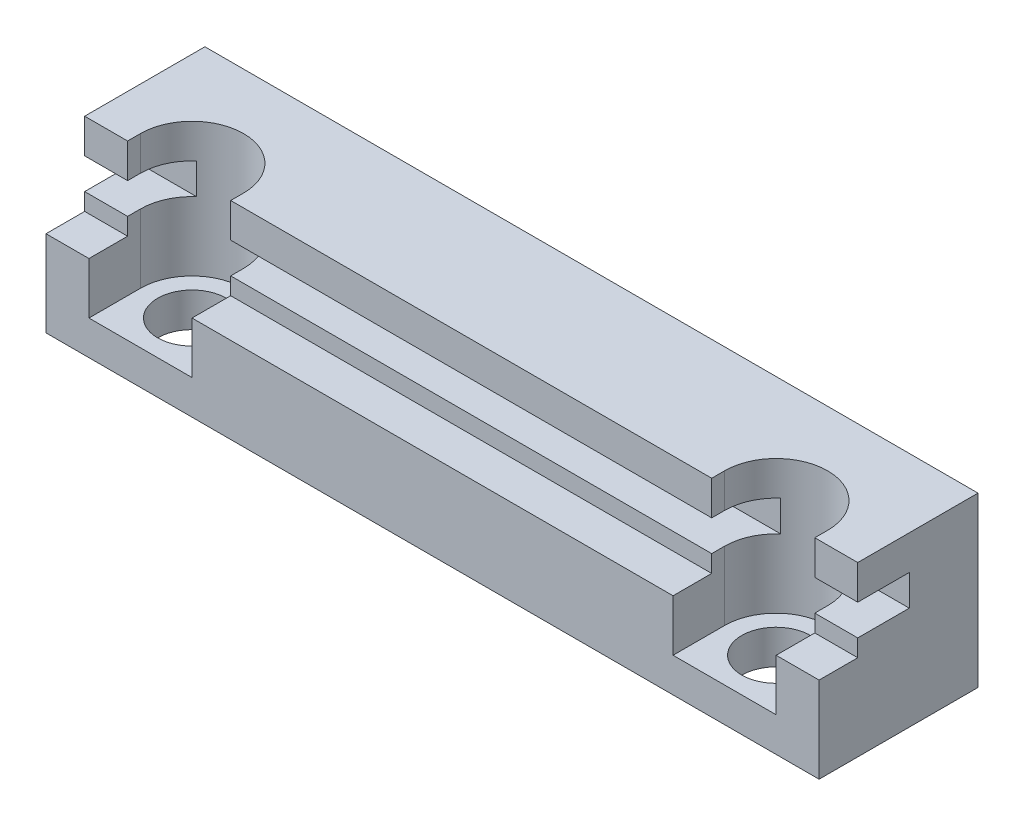
ISO-10303-21;
HEADER;
FILE_DESCRIPTION(('STEP AP214'),'2;1');
FILE_NAME('part.step','',(''),(''),'','','');
FILE_SCHEMA(('AUTOMOTIVE_DESIGN { 1 0 10303 214 1 1 1 1 }'));
ENDSEC;
DATA;
#1=APPLICATION_CONTEXT('core data for automotive mechanical design processes');
#2=APPLICATION_PROTOCOL_DEFINITION('international standard','automotive_design',2000,#1);
#3=PRODUCT_CONTEXT('',#1,'mechanical');
#4=PRODUCT('Part','Part','',(#3));
#5=PRODUCT_RELATED_PRODUCT_CATEGORY('part','',(#4));
#6=PRODUCT_DEFINITION_FORMATION('','',#4);
#7=PRODUCT_DEFINITION_CONTEXT('part definition',#1,'design');
#8=PRODUCT_DEFINITION('design','',#6,#7);
#9=PRODUCT_DEFINITION_SHAPE('','',#8);
#10=(LENGTH_UNIT() NAMED_UNIT(*) SI_UNIT(.MILLI.,.METRE.));
#11=(NAMED_UNIT(*) PLANE_ANGLE_UNIT() SI_UNIT($,.RADIAN.));
#12=(NAMED_UNIT(*) SI_UNIT($,.STERADIAN.) SOLID_ANGLE_UNIT());
#13=UNCERTAINTY_MEASURE_WITH_UNIT(LENGTH_MEASURE(1.E-05),#10,'distance_accuracy_value','');
#14=(GEOMETRIC_REPRESENTATION_CONTEXT(3) GLOBAL_UNCERTAINTY_ASSIGNED_CONTEXT((#13)) GLOBAL_UNIT_ASSIGNED_CONTEXT((#10,
#11,#12)) REPRESENTATION_CONTEXT('',''));
#15=CARTESIAN_POINT('',(0.,0.,0.));
#16=DIRECTION('',(0.,0.,1.));
#17=DIRECTION('',(1.,0.,0.));
#18=AXIS2_PLACEMENT_3D('',#15,#16,#17);
#19=CARTESIAN_POINT('',(45.,7.8,-3.));
#20=DIRECTION('',(0.,1.,0.));
#21=DIRECTION('',(0.,0.,1.));
#22=AXIS2_PLACEMENT_3D('',#19,#20,#21);
#23=PLANE('',#22);
#24=DIRECTION('',(0.,0.,-1.));
#25=VECTOR('',#24,1.);
#26=CARTESIAN_POINT('',(42.5,7.8,-3.));
#27=LINE('',#26,#25);
#28=CARTESIAN_POINT('',(42.5,7.8,0.));
#29=VERTEX_POINT('',#28);
#30=CARTESIAN_POINT('',(42.5,7.8,-0.750000000000003));
#31=VERTEX_POINT('',#30);
#32=EDGE_CURVE('E324',#29,#31,#27,.T.);
#33=ORIENTED_EDGE('',*,*,#32,.T.);
#34=CARTESIAN_POINT('',(39.5,7.8,-0.750000000000003));
#35=DIRECTION('',(0.,1.,0.));
#36=DIRECTION('',(0.,0.,1.));
#37=AXIS2_PLACEMENT_3D('',#34,#35,#36);
#38=CIRCLE('',#37,3.);
#39=CARTESIAN_POINT('',(41.4843134832985,7.8,-3.));
#40=VERTEX_POINT('',#39);
#41=EDGE_CURVE('E330',#31,#40,#38,.T.);
#42=ORIENTED_EDGE('',*,*,#41,.T.);
#43=DIRECTION('',(-1.,0.,0.));
#44=VECTOR('',#43,1.);
#45=CARTESIAN_POINT('',(45.,7.8,-3.));
#46=LINE('',#45,#44);
#47=CARTESIAN_POINT('',(45.,7.8,-3.));
#48=VERTEX_POINT('',#47);
#49=EDGE_CURVE('E483',#48,#40,#46,.T.);
#50=ORIENTED_EDGE('',*,*,#49,.F.);
#51=DIRECTION('',(0.,0.,-1.));
#52=VECTOR('',#51,1.);
#53=CARTESIAN_POINT('',(45.,7.8,-3.));
#54=LINE('',#53,#52);
#55=CARTESIAN_POINT('',(45.,7.8,0.));
#56=VERTEX_POINT('',#55);
#57=EDGE_CURVE('E421',#56,#48,#54,.T.);
#58=ORIENTED_EDGE('',*,*,#57,.F.);
#59=DIRECTION('',(-1.,0.,0.));
#60=VECTOR('',#59,1.);
#61=CARTESIAN_POINT('',(45.,7.8,0.));
#62=LINE('',#61,#60);
#63=EDGE_CURVE('E488',#56,#29,#62,.T.);
#64=ORIENTED_EDGE('',*,*,#63,.T.);
#65=EDGE_LOOP('',(#33,#42,#50,#58,#64));
#66=FACE_BOUND('',#65,.T.);
#67=ADVANCED_FACE('F35',(#66),#23,.F.);
#68=CARTESIAN_POINT('',(45.,6.,0.));
#69=DIRECTION('',(0.,-1.,0.));
#70=DIRECTION('',(0.,0.,-1.));
#71=AXIS2_PLACEMENT_3D('',#68,#69,#70);
#72=PLANE('',#71);
#73=DIRECTION('',(-1.,0.,0.));
#74=VECTOR('',#73,1.);
#75=CARTESIAN_POINT('',(45.,6.,-3.));
#76=LINE('',#75,#74);
#77=CARTESIAN_POINT('',(45.,6.,-3.));
#78=VERTEX_POINT('',#77);
#79=CARTESIAN_POINT('',(41.4843134832985,6.,-3.));
#80=VERTEX_POINT('',#79);
#81=EDGE_CURVE('E478',#78,#80,#76,.T.);
#82=ORIENTED_EDGE('',*,*,#81,.T.);
#83=CARTESIAN_POINT('',(39.5,6.,-0.750000000000003));
#84=DIRECTION('',(0.,-1.,0.));
#85=DIRECTION('',(0.,0.,-1.));
#86=AXIS2_PLACEMENT_3D('',#83,#84,#85);
#87=CIRCLE('',#86,3.);
#88=CARTESIAN_POINT('',(42.5,6.,-0.750000000000003));
#89=VERTEX_POINT('',#88);
#90=EDGE_CURVE('E327',#80,#89,#87,.T.);
#91=ORIENTED_EDGE('',*,*,#90,.T.);
#92=DIRECTION('',(0.,0.,1.));
#93=VECTOR('',#92,1.);
#94=CARTESIAN_POINT('',(42.5,6.,0.));
#95=LINE('',#94,#93);
#96=CARTESIAN_POINT('',(42.5,6.,0.));
#97=VERTEX_POINT('',#96);
#98=EDGE_CURVE('E318',#89,#97,#95,.T.);
#99=ORIENTED_EDGE('',*,*,#98,.T.);
#100=DIRECTION('',(-1.,0.,0.));
#101=VECTOR('',#100,1.);
#102=CARTESIAN_POINT('',(45.,6.,0.));
#103=LINE('',#102,#101);
#104=CARTESIAN_POINT('',(45.,6.,0.));
#105=VERTEX_POINT('',#104);
#106=EDGE_CURVE('E473',#105,#97,#103,.T.);
#107=ORIENTED_EDGE('',*,*,#106,.F.);
#108=DIRECTION('',(0.,0.,1.));
#109=VECTOR('',#108,1.);
#110=CARTESIAN_POINT('',(45.,6.,0.));
#111=LINE('',#110,#109);
#112=EDGE_CURVE('E425',#78,#105,#111,.T.);
#113=ORIENTED_EDGE('',*,*,#112,.F.);
#114=EDGE_LOOP('',(#82,#91,#99,#107,#113));
#115=FACE_BOUND('',#114,.T.);
#116=ADVANCED_FACE('F595',(#115),#72,.F.);
#117=CARTESIAN_POINT('',(45.,5.,2.25));
#118=DIRECTION('',(0.,-1.,0.));
#119=DIRECTION('',(0.,0.,-1.));
#120=AXIS2_PLACEMENT_3D('',#117,#118,#119);
#121=PLANE('',#120);
#122=DIRECTION('',(-1.,0.,0.));
#123=VECTOR('',#122,1.);
#124=CARTESIAN_POINT('',(45.,5.,0.));
#125=LINE('',#124,#123);
#126=CARTESIAN_POINT('',(45.,5.,0.));
#127=VERTEX_POINT('',#126);
#128=CARTESIAN_POINT('',(42.5,5.,0.));
#129=VERTEX_POINT('',#128);
#130=EDGE_CURVE('E468',#127,#129,#125,.T.);
#131=ORIENTED_EDGE('',*,*,#130,.T.);
#132=DIRECTION('',(0.,0.,1.));
#133=VECTOR('',#132,1.);
#134=CARTESIAN_POINT('',(42.5,5.,2.25));
#135=LINE('',#134,#133);
#136=CARTESIAN_POINT('',(42.5,5.,2.25));
#137=VERTEX_POINT('',#136);
#138=EDGE_CURVE('E315',#129,#137,#135,.T.);
#139=ORIENTED_EDGE('',*,*,#138,.T.);
#140=DIRECTION('',(-1.,0.,0.));
#141=VECTOR('',#140,1.);
#142=CARTESIAN_POINT('',(45.,5.,2.25));
#143=LINE('',#142,#141);
#144=CARTESIAN_POINT('',(45.,5.,2.25));
#145=VERTEX_POINT('',#144);
#146=EDGE_CURVE('E463',#145,#137,#143,.T.);
#147=ORIENTED_EDGE('',*,*,#146,.F.);
#148=DIRECTION('',(0.,0.,1.));
#149=VECTOR('',#148,1.);
#150=CARTESIAN_POINT('',(45.,5.,2.25));
#151=LINE('',#150,#149);
#152=EDGE_CURVE('E429',#127,#145,#151,.T.);
#153=ORIENTED_EDGE('',*,*,#152,.F.);
#154=EDGE_LOOP('',(#131,#139,#147,#153));
#155=FACE_BOUND('',#154,.T.);
#156=ADVANCED_FACE('F585',(#155),#121,.F.);
#157=CARTESIAN_POINT('',(45.,6.,-3.));
#158=DIRECTION('',(0.,0.,-1.));
#159=DIRECTION('',(-1.,0.,0.));
#160=AXIS2_PLACEMENT_3D('',#157,#158,#159);
#161=PLANE('',#160);
#162=CARTESIAN_POINT('',(37.5156865167015,6.,-3.));
#163=VERTEX_POINT('',#162);
#164=CARTESIAN_POINT('',(7.48431348329844,6.,-3.));
#165=VERTEX_POINT('',#164);
#166=EDGE_CURVE('E482',#163,#165,#76,.T.);
#167=ORIENTED_EDGE('',*,*,#166,.F.);
#168=DIRECTION('',(0.,1.,0.));
#169=VECTOR('',#168,1.);
#170=CARTESIAN_POINT('',(37.5156865167015,2.,-3.));
#171=LINE('',#170,#169);
#172=CARTESIAN_POINT('',(37.5156865167015,7.8,-3.));
#173=VERTEX_POINT('',#172);
#174=EDGE_CURVE('E11',#163,#173,#171,.T.);
#175=ORIENTED_EDGE('',*,*,#174,.T.);
#176=CARTESIAN_POINT('',(7.48431348329844,7.8,-3.));
#177=VERTEX_POINT('',#176);
#178=EDGE_CURVE('E487',#173,#177,#46,.T.);
#179=ORIENTED_EDGE('',*,*,#178,.T.);
#180=DIRECTION('',(0.,1.,0.));
#181=VECTOR('',#180,1.);
#182=CARTESIAN_POINT('',(7.48431348329844,2.,-3.));
#183=LINE('',#182,#181);
#184=EDGE_CURVE('E401',#177,#165,#183,.F.);
#185=ORIENTED_EDGE('',*,*,#184,.T.);
#186=EDGE_LOOP('',(#167,#175,#179,#185));
#187=FACE_BOUND('',#186,.T.);
#188=ADVANCED_FACE('F525',(#187),#161,.F.);
#189=CARTESIAN_POINT('',(39.5,0.,-0.750000000000003));
#190=DIRECTION('',(0.,1.,0.));
#191=DIRECTION('',(0.,0.,1.));
#192=AXIS2_PLACEMENT_3D('',#189,#190,#191);
#193=CYLINDRICAL_SURFACE('',#192,2.);
#194=CARTESIAN_POINT('',(39.5,0.,-0.750000000000003));
#195=DIRECTION('',(0.,1.,0.));
#196=DIRECTION('',(0.,0.,1.));
#197=AXIS2_PLACEMENT_3D('',#194,#195,#196);
#198=CIRCLE('',#197,2.);
#199=CARTESIAN_POINT('',(39.5,0.,1.25));
#200=VERTEX_POINT('',#199);
#201=EDGE_CURVE('E405',#200,#200,#198,.T.);
#202=ORIENTED_EDGE('',*,*,#201,.F.);
#203=EDGE_LOOP('',(#202));
#204=FACE_BOUND('',#203,.T.);
#205=CARTESIAN_POINT('',(39.5,2.,-0.750000000000003));
#206=DIRECTION('',(0.,1.,0.));
#207=DIRECTION('',(0.,0.,1.));
#208=AXIS2_PLACEMENT_3D('',#205,#206,#207);
#209=CIRCLE('',#208,2.);
#210=CARTESIAN_POINT('',(39.5,2.,1.25));
#211=VERTEX_POINT('',#210);
#212=EDGE_CURVE('E293',#211,#211,#209,.F.);
#213=ORIENTED_EDGE('',*,*,#212,.F.);
#214=EDGE_LOOP('',(#213));
#215=FACE_BOUND('',#214,.T.);
#216=ADVANCED_FACE('F646',(#204,#215),#193,.F.);
#217=ORIENTED_EDGE('',*,*,#178,.F.);
#218=CARTESIAN_POINT('',(36.5,7.8,-0.750000000000003));
#219=VERTEX_POINT('',#218);
#220=EDGE_CURVE('E333',#173,#219,#38,.T.);
#221=ORIENTED_EDGE('',*,*,#220,.T.);
#222=DIRECTION('',(0.,0.,1.));
#223=VECTOR('',#222,1.);
#224=CARTESIAN_POINT('',(36.5,7.8,-2.99999999999998));
#225=LINE('',#224,#223);
#226=CARTESIAN_POINT('',(36.5,7.8,0.));
#227=VERTEX_POINT('',#226);
#228=EDGE_CURVE('E309',#219,#227,#225,.T.);
#229=ORIENTED_EDGE('',*,*,#228,.T.);
#230=CARTESIAN_POINT('',(8.5,7.8,0.));
#231=VERTEX_POINT('',#230);
#232=EDGE_CURVE('E492',#227,#231,#62,.T.);
#233=ORIENTED_EDGE('',*,*,#232,.T.);
#234=DIRECTION('',(0.,0.,-1.));
#235=VECTOR('',#234,1.);
#236=CARTESIAN_POINT('',(8.49999999999999,7.8,-2.99999999999994));
#237=LINE('',#236,#235);
#238=CARTESIAN_POINT('',(8.5,7.8,-0.750000000000002));
#239=VERTEX_POINT('',#238);
#240=EDGE_CURVE('E389',#231,#239,#237,.T.);
#241=ORIENTED_EDGE('',*,*,#240,.T.);
#242=CARTESIAN_POINT('',(5.5,7.8,-0.750000000000002));
#243=DIRECTION('',(0.,1.,0.));
#244=DIRECTION('',(0.,0.,1.));
#245=AXIS2_PLACEMENT_3D('',#242,#243,#244);
#246=CIRCLE('',#245,3.);
#247=EDGE_CURVE('E402',#239,#177,#246,.T.);
#248=ORIENTED_EDGE('',*,*,#247,.T.);
#249=EDGE_LOOP('',(#217,#221,#229,#233,#241,#248));
#250=FACE_BOUND('',#249,.T.);
#251=ADVANCED_FACE('F616',(#250),#23,.F.);
#252=CARTESIAN_POINT('',(3.51568651670155,6.,-3.));
#253=VERTEX_POINT('',#252);
#254=CARTESIAN_POINT('',(0.,6.,-3.));
#255=VERTEX_POINT('',#254);
#256=EDGE_CURVE('E476',#253,#255,#76,.T.);
#257=ORIENTED_EDGE('',*,*,#256,.F.);
#258=DIRECTION('',(0.,1.,0.));
#259=VECTOR('',#258,1.);
#260=CARTESIAN_POINT('',(3.51568651670155,2.,-3.));
#261=LINE('',#260,#259);
#262=CARTESIAN_POINT('',(3.51568651670155,7.8,-3.));
#263=VERTEX_POINT('',#262);
#264=EDGE_CURVE('E395',#253,#263,#261,.T.);
#265=ORIENTED_EDGE('',*,*,#264,.T.);
#266=CARTESIAN_POINT('',(0.,7.8,-3.));
#267=VERTEX_POINT('',#266);
#268=EDGE_CURVE('E481',#263,#267,#46,.T.);
#269=ORIENTED_EDGE('',*,*,#268,.T.);
#270=DIRECTION('',(0.,-1.,0.));
#271=VECTOR('',#270,1.);
#272=CARTESIAN_POINT('',(0.,6.,-3.));
#273=LINE('',#272,#271);
#274=EDGE_CURVE('E446',#267,#255,#273,.T.);
#275=ORIENTED_EDGE('',*,*,#274,.T.);
#276=EDGE_LOOP('',(#257,#265,#269,#275));
#277=FACE_BOUND('',#276,.T.);
#278=ADVANCED_FACE('F532',(#277),#161,.F.);
#279=DIRECTION('',(0.,0.,-1.));
#280=VECTOR('',#279,1.);
#281=CARTESIAN_POINT('',(36.5,6.,0.));
#282=LINE('',#281,#280);
#283=CARTESIAN_POINT('',(36.5,6.,0.));
#284=VERTEX_POINT('',#283);
#285=CARTESIAN_POINT('',(36.5,6.,-0.750000000000003));
#286=VERTEX_POINT('',#285);
#287=EDGE_CURVE('E304',#284,#286,#282,.T.);
#288=ORIENTED_EDGE('',*,*,#287,.T.);
#289=EDGE_CURVE('E264',#286,#163,#87,.T.);
#290=ORIENTED_EDGE('',*,*,#289,.T.);
#291=ORIENTED_EDGE('',*,*,#166,.T.);
#292=CARTESIAN_POINT('',(5.5,6.,-0.750000000000002));
#293=DIRECTION('',(0.,-1.,0.));
#294=DIRECTION('',(0.,0.,-1.));
#295=AXIS2_PLACEMENT_3D('',#292,#293,#294);
#296=CIRCLE('',#295,3.);
#297=CARTESIAN_POINT('',(8.5,6.,-0.750000000000002));
#298=VERTEX_POINT('',#297);
#299=EDGE_CURVE('E508',#165,#298,#296,.T.);
#300=ORIENTED_EDGE('',*,*,#299,.T.);
#301=DIRECTION('',(0.,0.,1.));
#302=VECTOR('',#301,1.);
#303=CARTESIAN_POINT('',(8.49999999999999,6.,0.));
#304=LINE('',#303,#302);
#305=CARTESIAN_POINT('',(8.49999999999999,6.,0.));
#306=VERTEX_POINT('',#305);
#307=EDGE_CURVE('E386',#298,#306,#304,.T.);
#308=ORIENTED_EDGE('',*,*,#307,.T.);
#309=EDGE_CURVE('E477',#284,#306,#103,.T.);
#310=ORIENTED_EDGE('',*,*,#309,.F.);
#311=EDGE_LOOP('',(#288,#290,#291,#300,#308,#310));
#312=FACE_BOUND('',#311,.T.);
#313=ADVANCED_FACE('F516',(#312),#72,.F.);
#314=CARTESIAN_POINT('',(36.5,5.,2.25));
#315=VERTEX_POINT('',#314);
#316=CARTESIAN_POINT('',(8.5,5.,2.25));
#317=VERTEX_POINT('',#316);
#318=EDGE_CURVE('E467',#315,#317,#143,.T.);
#319=ORIENTED_EDGE('',*,*,#318,.F.);
#320=DIRECTION('',(0.,0.,-1.));
#321=VECTOR('',#320,1.);
#322=CARTESIAN_POINT('',(36.5,5.,2.25000000000002));
#323=LINE('',#322,#321);
#324=CARTESIAN_POINT('',(36.5,5.,0.));
#325=VERTEX_POINT('',#324);
#326=EDGE_CURVE('E301',#315,#325,#323,.T.);
#327=ORIENTED_EDGE('',*,*,#326,.T.);
#328=CARTESIAN_POINT('',(8.5,5.,0.));
#329=VERTEX_POINT('',#328);
#330=EDGE_CURVE('E472',#325,#329,#125,.T.);
#331=ORIENTED_EDGE('',*,*,#330,.T.);
#332=DIRECTION('',(0.,0.,1.));
#333=VECTOR('',#332,1.);
#334=CARTESIAN_POINT('',(8.5,5.,2.25000000000006));
#335=LINE('',#334,#333);
#336=EDGE_CURVE('E380',#329,#317,#335,.T.);
#337=ORIENTED_EDGE('',*,*,#336,.T.);
#338=EDGE_LOOP('',(#319,#327,#331,#337));
#339=FACE_BOUND('',#338,.T.);
#340=ADVANCED_FACE('F622',(#339),#121,.F.);
#341=CARTESIAN_POINT('',(5.5,0.,-0.750000000000002));
#342=DIRECTION('',(0.,1.,0.));
#343=DIRECTION('',(0.,0.,1.));
#344=AXIS2_PLACEMENT_3D('',#341,#342,#343);
#345=CYLINDRICAL_SURFACE('',#344,2.);
#346=CARTESIAN_POINT('',(5.5,0.,-0.750000000000002));
#347=DIRECTION('',(0.,1.,0.));
#348=DIRECTION('',(0.,0.,1.));
#349=AXIS2_PLACEMENT_3D('',#346,#347,#348);
#350=CIRCLE('',#349,2.);
#351=CARTESIAN_POINT('',(5.5,0.,1.25));
#352=VERTEX_POINT('',#351);
#353=EDGE_CURVE('E408',#352,#352,#350,.T.);
#354=ORIENTED_EDGE('',*,*,#353,.F.);
#355=EDGE_LOOP('',(#354));
#356=FACE_BOUND('',#355,.T.);
#357=CARTESIAN_POINT('',(5.5,2.,-0.750000000000002));
#358=DIRECTION('',(0.,1.,0.));
#359=DIRECTION('',(0.,0.,1.));
#360=AXIS2_PLACEMENT_3D('',#357,#358,#359);
#361=CIRCLE('',#360,2.);
#362=CARTESIAN_POINT('',(5.5,2.,1.25));
#363=VERTEX_POINT('',#362);
#364=EDGE_CURVE('E354',#363,#363,#361,.F.);
#365=ORIENTED_EDGE('',*,*,#364,.F.);
#366=EDGE_LOOP('',(#365));
#367=FACE_BOUND('',#366,.T.);
#368=ADVANCED_FACE('F624',(#356,#367),#345,.F.);
#369=CARTESIAN_POINT('',(45.,7.8,0.));
#370=DIRECTION('',(0.,0.,-1.));
#371=DIRECTION('',(-1.,0.,0.));
#372=AXIS2_PLACEMENT_3D('',#369,#370,#371);
#373=PLANE('',#372);
#374=ORIENTED_EDGE('',*,*,#232,.F.);
#375=DIRECTION('',(0.,1.,0.));
#376=VECTOR('',#375,1.);
#377=CARTESIAN_POINT('',(36.5,7.8,0.));
#378=LINE('',#377,#376);
#379=CARTESIAN_POINT('',(36.5,9.8,0.));
#380=VERTEX_POINT('',#379);
#381=EDGE_CURVE('E306',#227,#380,#378,.T.);
#382=ORIENTED_EDGE('',*,*,#381,.T.);
#383=DIRECTION('',(-1.,0.,0.));
#384=VECTOR('',#383,1.);
#385=CARTESIAN_POINT('',(45.,9.8,0.));
#386=LINE('',#385,#384);
#387=CARTESIAN_POINT('',(8.5,9.8,0.));
#388=VERTEX_POINT('',#387);
#389=EDGE_CURVE('E497',#380,#388,#386,.T.);
#390=ORIENTED_EDGE('',*,*,#389,.T.);
#391=DIRECTION('',(0.,-1.,0.));
#392=VECTOR('',#391,1.);
#393=CARTESIAN_POINT('',(8.49999999999999,7.8,0.));
#394=LINE('',#393,#392);
#395=EDGE_CURVE('E392',#388,#231,#394,.T.);
#396=ORIENTED_EDGE('',*,*,#395,.T.);
#397=EDGE_LOOP('',(#374,#382,#390,#396));
#398=FACE_BOUND('',#397,.T.);
#399=ADVANCED_FACE('F630',(#398),#373,.F.);
#400=CARTESIAN_POINT('',(45.,5.,0.));
#401=DIRECTION('',(0.,0.,-1.));
#402=DIRECTION('',(-1.,0.,0.));
#403=AXIS2_PLACEMENT_3D('',#400,#401,#402);
#404=PLANE('',#403);
#405=ORIENTED_EDGE('',*,*,#330,.F.);
#406=DIRECTION('',(0.,1.,0.));
#407=VECTOR('',#406,1.);
#408=CARTESIAN_POINT('',(36.5,5.,0.));
#409=LINE('',#408,#407);
#410=EDGE_CURVE('E298',#325,#284,#409,.T.);
#411=ORIENTED_EDGE('',*,*,#410,.T.);
#412=ORIENTED_EDGE('',*,*,#309,.T.);
#413=DIRECTION('',(0.,-1.,0.));
#414=VECTOR('',#413,1.);
#415=CARTESIAN_POINT('',(8.49999999999999,5.,0.));
#416=LINE('',#415,#414);
#417=EDGE_CURVE('E383',#306,#329,#416,.T.);
#418=ORIENTED_EDGE('',*,*,#417,.T.);
#419=EDGE_LOOP('',(#405,#411,#412,#418));
#420=FACE_BOUND('',#419,.T.);
#421=ADVANCED_FACE('F620',(#420),#404,.F.);
#422=CARTESIAN_POINT('',(2.5,7.8,0.));
#423=VERTEX_POINT('',#422);
#424=CARTESIAN_POINT('',(0.,7.8,0.));
#425=VERTEX_POINT('',#424);
#426=EDGE_CURVE('E486',#423,#425,#62,.T.);
#427=ORIENTED_EDGE('',*,*,#426,.F.);
#428=DIRECTION('',(0.,1.,0.));
#429=VECTOR('',#428,1.);
#430=CARTESIAN_POINT('',(2.5,7.8,0.));
#431=LINE('',#430,#429);
#432=CARTESIAN_POINT('',(2.5,9.8,0.));
#433=VERTEX_POINT('',#432);
#434=EDGE_CURVE('E377',#423,#433,#431,.T.);
#435=ORIENTED_EDGE('',*,*,#434,.T.);
#436=CARTESIAN_POINT('',(0.,9.8,0.));
#437=VERTEX_POINT('',#436);
#438=EDGE_CURVE('E491',#433,#437,#386,.T.);
#439=ORIENTED_EDGE('',*,*,#438,.T.);
#440=DIRECTION('',(0.,-1.,0.));
#441=VECTOR('',#440,1.);
#442=CARTESIAN_POINT('',(0.,7.8,0.));
#443=LINE('',#442,#441);
#444=EDGE_CURVE('E440',#437,#425,#443,.T.);
#445=ORIENTED_EDGE('',*,*,#444,.T.);
#446=EDGE_LOOP('',(#427,#435,#439,#445));
#447=FACE_BOUND('',#446,.T.);
#448=ADVANCED_FACE('F652',(#447),#373,.F.);
#449=CARTESIAN_POINT('',(2.5,5.,0.));
#450=VERTEX_POINT('',#449);
#451=CARTESIAN_POINT('',(0.,5.,0.));
#452=VERTEX_POINT('',#451);
#453=EDGE_CURVE('E466',#450,#452,#125,.T.);
#454=ORIENTED_EDGE('',*,*,#453,.F.);
#455=DIRECTION('',(0.,1.,0.));
#456=VECTOR('',#455,1.);
#457=CARTESIAN_POINT('',(2.5,5.,0.));
#458=LINE('',#457,#456);
#459=CARTESIAN_POINT('',(2.5,6.,0.));
#460=VERTEX_POINT('',#459);
#461=EDGE_CURVE('E368',#450,#460,#458,.T.);
#462=ORIENTED_EDGE('',*,*,#461,.T.);
#463=CARTESIAN_POINT('',(0.,6.,0.));
#464=VERTEX_POINT('',#463);
#465=EDGE_CURVE('E471',#460,#464,#103,.T.);
#466=ORIENTED_EDGE('',*,*,#465,.T.);
#467=DIRECTION('',(0.,-1.,0.));
#468=VECTOR('',#467,1.);
#469=CARTESIAN_POINT('',(0.,5.,0.));
#470=LINE('',#469,#468);
#471=EDGE_CURVE('E452',#464,#452,#470,.T.);
#472=ORIENTED_EDGE('',*,*,#471,.T.);
#473=EDGE_LOOP('',(#454,#462,#466,#472));
#474=FACE_BOUND('',#473,.T.);
#475=ADVANCED_FACE('F660',(#474),#404,.F.);
#476=CARTESIAN_POINT('',(45.,0.,-7.));
#477=DIRECTION('',(0.,1.,0.));
#478=DIRECTION('',(0.,0.,1.));
#479=AXIS2_PLACEMENT_3D('',#476,#477,#478);
#480=PLANE('',#479);
#481=ORIENTED_EDGE('',*,*,#201,.T.);
#482=EDGE_LOOP('',(#481));
#483=FACE_BOUND('',#482,.T.);
#484=ORIENTED_EDGE('',*,*,#353,.T.);
#485=EDGE_LOOP('',(#484));
#486=FACE_BOUND('',#485,.T.);
#487=DIRECTION('',(0.,0.,-1.));
#488=VECTOR('',#487,1.);
#489=CARTESIAN_POINT('',(0.,0.,-7.));
#490=LINE('',#489,#488);
#491=CARTESIAN_POINT('',(0.,0.,2.25));
#492=VERTEX_POINT('',#491);
#493=CARTESIAN_POINT('',(0.,0.,-7.));
#494=VERTEX_POINT('',#493);
#495=EDGE_CURVE('E411',#492,#494,#490,.T.);
#496=ORIENTED_EDGE('',*,*,#495,.T.);
#497=DIRECTION('',(-1.,0.,0.));
#498=VECTOR('',#497,1.);
#499=CARTESIAN_POINT('',(45.,0.,-7.));
#500=LINE('',#499,#498);
#501=CARTESIAN_POINT('',(45.,0.,-7.));
#502=VERTEX_POINT('',#501);
#503=EDGE_CURVE('E500',#502,#494,#500,.T.);
#504=ORIENTED_EDGE('',*,*,#503,.F.);
#505=DIRECTION('',(0.,0.,-1.));
#506=VECTOR('',#505,1.);
#507=CARTESIAN_POINT('',(45.,0.,2.25));
#508=LINE('',#507,#506);
#509=CARTESIAN_POINT('',(45.,0.,2.25));
#510=VERTEX_POINT('',#509);
#511=EDGE_CURVE('E412',#510,#502,#508,.T.);
#512=ORIENTED_EDGE('',*,*,#511,.F.);
#513=DIRECTION('',(-1.,0.,0.));
#514=VECTOR('',#513,1.);
#515=CARTESIAN_POINT('',(45.,0.,2.25));
#516=LINE('',#515,#514);
#517=EDGE_CURVE('E433',#510,#492,#516,.T.);
#518=ORIENTED_EDGE('',*,*,#517,.T.);
#519=EDGE_LOOP('',(#496,#504,#512,#518));
#520=FACE_BOUND('',#519,.T.);
#521=ADVANCED_FACE('F37',(#483,#486,#520),#480,.F.);
#522=CARTESIAN_POINT('',(45.,9.8,-7.));
#523=DIRECTION('',(0.,0.,1.));
#524=DIRECTION('',(0.,-1.,0.));
#525=AXIS2_PLACEMENT_3D('',#522,#523,#524);
#526=PLANE('',#525);
#527=DIRECTION('',(0.,1.,0.));
#528=VECTOR('',#527,1.);
#529=CARTESIAN_POINT('',(0.,9.8,-7.));
#530=LINE('',#529,#528);
#531=CARTESIAN_POINT('',(0.,9.8,-7.));
#532=VERTEX_POINT('',#531);
#533=EDGE_CURVE('E435',#494,#532,#530,.T.);
#534=ORIENTED_EDGE('',*,*,#533,.T.);
#535=DIRECTION('',(-1.,0.,0.));
#536=VECTOR('',#535,1.);
#537=CARTESIAN_POINT('',(45.,9.8,-7.));
#538=LINE('',#537,#536);
#539=CARTESIAN_POINT('',(45.,9.8,-7.));
#540=VERTEX_POINT('',#539);
#541=EDGE_CURVE('E496',#540,#532,#538,.T.);
#542=ORIENTED_EDGE('',*,*,#541,.F.);
#543=DIRECTION('',(0.,1.,0.));
#544=VECTOR('',#543,1.);
#545=CARTESIAN_POINT('',(45.,9.8,-7.));
#546=LINE('',#545,#544);
#547=EDGE_CURVE('E414',#502,#540,#546,.T.);
#548=ORIENTED_EDGE('',*,*,#547,.F.);
#549=ORIENTED_EDGE('',*,*,#503,.T.);
#550=EDGE_LOOP('',(#534,#542,#548,#549));
#551=FACE_BOUND('',#550,.T.);
#552=ADVANCED_FACE('F574',(#551),#526,.F.);
#553=CARTESIAN_POINT('',(45.,9.8,0.));
#554=DIRECTION('',(0.,-1.,0.));
#555=DIRECTION('',(0.,0.,-1.));
#556=AXIS2_PLACEMENT_3D('',#553,#554,#555);
#557=PLANE('',#556);
#558=CARTESIAN_POINT('',(39.5,9.8,-0.750000000000003));
#559=DIRECTION('',(0.,1.,0.));
#560=DIRECTION('',(0.,0.,1.));
#561=AXIS2_PLACEMENT_3D('',#558,#559,#560);
#562=CIRCLE('',#561,3.);
#563=CARTESIAN_POINT('',(42.5,9.8,-0.750000000000003));
#564=VERTEX_POINT('',#563);
#565=CARTESIAN_POINT('',(36.5,9.8,-0.750000000000003));
#566=VERTEX_POINT('',#565);
#567=EDGE_CURVE('E287',#564,#566,#562,.T.);
#568=ORIENTED_EDGE('',*,*,#567,.F.);
#569=DIRECTION('',(0.,0.,-1.));
#570=VECTOR('',#569,1.);
#571=CARTESIAN_POINT('',(42.5,9.8,2.25));
#572=LINE('',#571,#570);
#573=CARTESIAN_POINT('',(42.5,9.8,0.));
#574=VERTEX_POINT('',#573);
#575=EDGE_CURVE('E279',#574,#564,#572,.T.);
#576=ORIENTED_EDGE('',*,*,#575,.F.);
#577=CARTESIAN_POINT('',(45.,9.8,0.));
#578=VERTEX_POINT('',#577);
#579=EDGE_CURVE('E493',#578,#574,#386,.T.);
#580=ORIENTED_EDGE('',*,*,#579,.F.);
#581=DIRECTION('',(0.,0.,1.));
#582=VECTOR('',#581,1.);
#583=CARTESIAN_POINT('',(45.,9.8,0.));
#584=LINE('',#583,#582);
#585=EDGE_CURVE('E417',#540,#578,#584,.T.);
#586=ORIENTED_EDGE('',*,*,#585,.F.);
#587=ORIENTED_EDGE('',*,*,#541,.T.);
#588=DIRECTION('',(0.,0.,1.));
#589=VECTOR('',#588,1.);
#590=CARTESIAN_POINT('',(0.,9.8,0.));
#591=LINE('',#590,#589);
#592=EDGE_CURVE('E437',#532,#437,#591,.T.);
#593=ORIENTED_EDGE('',*,*,#592,.T.);
#594=ORIENTED_EDGE('',*,*,#438,.F.);
#595=DIRECTION('',(0.,0.,1.));
#596=VECTOR('',#595,1.);
#597=CARTESIAN_POINT('',(2.5,9.8,-0.750000000000002));
#598=LINE('',#597,#596);
#599=CARTESIAN_POINT('',(2.5,9.8,-0.750000000000002));
#600=VERTEX_POINT('',#599);
#601=EDGE_CURVE('E347',#600,#433,#598,.T.);
#602=ORIENTED_EDGE('',*,*,#601,.F.);
#603=CARTESIAN_POINT('',(5.5,9.8,-0.750000000000002));
#604=DIRECTION('',(0.,1.,0.));
#605=DIRECTION('',(0.,0.,1.));
#606=AXIS2_PLACEMENT_3D('',#603,#604,#605);
#607=CIRCLE('',#606,3.);
#608=CARTESIAN_POINT('',(8.5,9.8,-0.750000000000002));
#609=VERTEX_POINT('',#608);
#610=EDGE_CURVE('E344',#609,#600,#607,.T.);
#611=ORIENTED_EDGE('',*,*,#610,.F.);
#612=DIRECTION('',(0.,0.,-1.));
#613=VECTOR('',#612,1.);
#614=CARTESIAN_POINT('',(8.5,9.8,2.25));
#615=LINE('',#614,#613);
#616=EDGE_CURVE('E336',#388,#609,#615,.T.);
#617=ORIENTED_EDGE('',*,*,#616,.F.);
#618=ORIENTED_EDGE('',*,*,#389,.F.);
#619=DIRECTION('',(0.,0.,1.));
#620=VECTOR('',#619,1.);
#621=CARTESIAN_POINT('',(36.5,9.8,-0.750000000000003));
#622=LINE('',#621,#620);
#623=EDGE_CURVE('E282',#566,#380,#622,.T.);
#624=ORIENTED_EDGE('',*,*,#623,.F.);
#625=EDGE_LOOP('',(#568,#576,#580,#586,#587,#593,#594,#602,#611,#617,#618,#624));
#626=FACE_BOUND('',#625,.T.);
#627=ADVANCED_FACE('F611',(#626),#557,.F.);
#628=ORIENTED_EDGE('',*,*,#579,.T.);
#629=DIRECTION('',(0.,-1.,0.));
#630=VECTOR('',#629,1.);
#631=CARTESIAN_POINT('',(42.5,7.8,0.));
#632=LINE('',#631,#630);
#633=EDGE_CURVE('E321',#574,#29,#632,.T.);
#634=ORIENTED_EDGE('',*,*,#633,.T.);
#635=ORIENTED_EDGE('',*,*,#63,.F.);
#636=DIRECTION('',(0.,-1.,0.));
#637=VECTOR('',#636,1.);
#638=CARTESIAN_POINT('',(45.,7.8,0.));
#639=LINE('',#638,#637);
#640=EDGE_CURVE('E419',#578,#56,#639,.T.);
#641=ORIENTED_EDGE('',*,*,#640,.F.);
#642=EDGE_LOOP('',(#628,#634,#635,#641));
#643=FACE_BOUND('',#642,.T.);
#644=ADVANCED_FACE('F605',(#643),#373,.F.);
#645=ORIENTED_EDGE('',*,*,#268,.F.);
#646=CARTESIAN_POINT('',(2.5,7.8,-0.750000000000002));
#647=VERTEX_POINT('',#646);
#648=EDGE_CURVE('E398',#263,#647,#246,.T.);
#649=ORIENTED_EDGE('',*,*,#648,.T.);
#650=DIRECTION('',(0.,0.,1.));
#651=VECTOR('',#650,1.);
#652=CARTESIAN_POINT('',(2.5,7.8,-2.99999999999988));
#653=LINE('',#652,#651);
#654=EDGE_CURVE('E374',#647,#423,#653,.T.);
#655=ORIENTED_EDGE('',*,*,#654,.T.);
#656=ORIENTED_EDGE('',*,*,#426,.T.);
#657=DIRECTION('',(0.,0.,-1.));
#658=VECTOR('',#657,1.);
#659=CARTESIAN_POINT('',(0.,7.8,-3.));
#660=LINE('',#659,#658);
#661=EDGE_CURVE('E443',#425,#267,#660,.T.);
#662=ORIENTED_EDGE('',*,*,#661,.T.);
#663=EDGE_LOOP('',(#645,#649,#655,#656,#662));
#664=FACE_BOUND('',#663,.T.);
#665=ADVANCED_FACE('F537',(#664),#23,.F.);
#666=ORIENTED_EDGE('',*,*,#49,.T.);
#667=DIRECTION('',(0.,1.,0.));
#668=VECTOR('',#667,1.);
#669=CARTESIAN_POINT('',(41.4843134832985,2.,-3.));
#670=LINE('',#669,#668);
#671=EDGE_CURVE('E43',#40,#80,#670,.F.);
#672=ORIENTED_EDGE('',*,*,#671,.T.);
#673=ORIENTED_EDGE('',*,*,#81,.F.);
#674=DIRECTION('',(0.,-1.,0.));
#675=VECTOR('',#674,1.);
#676=CARTESIAN_POINT('',(45.,6.,-3.));
#677=LINE('',#676,#675);
#678=EDGE_CURVE('E423',#48,#78,#677,.T.);
#679=ORIENTED_EDGE('',*,*,#678,.F.);
#680=EDGE_LOOP('',(#666,#672,#673,#679));
#681=FACE_BOUND('',#680,.T.);
#682=ADVANCED_FACE('F601',(#681),#161,.F.);
#683=DIRECTION('',(0.,0.,-1.));
#684=VECTOR('',#683,1.);
#685=CARTESIAN_POINT('',(2.5,6.,1.22876246215024E-13));
#686=LINE('',#685,#684);
#687=CARTESIAN_POINT('',(2.5,6.,-0.750000000000002));
#688=VERTEX_POINT('',#687);
#689=EDGE_CURVE('E371',#460,#688,#686,.T.);
#690=ORIENTED_EDGE('',*,*,#689,.T.);
#691=EDGE_CURVE('E503',#688,#253,#296,.T.);
#692=ORIENTED_EDGE('',*,*,#691,.T.);
#693=ORIENTED_EDGE('',*,*,#256,.T.);
#694=DIRECTION('',(0.,0.,1.));
#695=VECTOR('',#694,1.);
#696=CARTESIAN_POINT('',(0.,6.,0.));
#697=LINE('',#696,#695);
#698=EDGE_CURVE('E449',#255,#464,#697,.T.);
#699=ORIENTED_EDGE('',*,*,#698,.T.);
#700=ORIENTED_EDGE('',*,*,#465,.F.);
#701=EDGE_LOOP('',(#690,#692,#693,#699,#700));
#702=FACE_BOUND('',#701,.T.);
#703=ADVANCED_FACE('F546',(#702),#72,.F.);
#704=ORIENTED_EDGE('',*,*,#106,.T.);
#705=DIRECTION('',(0.,-1.,0.));
#706=VECTOR('',#705,1.);
#707=CARTESIAN_POINT('',(42.5,5.,0.));
#708=LINE('',#707,#706);
#709=EDGE_CURVE('E312',#97,#129,#708,.T.);
#710=ORIENTED_EDGE('',*,*,#709,.T.);
#711=ORIENTED_EDGE('',*,*,#130,.F.);
#712=DIRECTION('',(0.,-1.,0.));
#713=VECTOR('',#712,1.);
#714=CARTESIAN_POINT('',(45.,5.,0.));
#715=LINE('',#714,#713);
#716=EDGE_CURVE('E427',#105,#127,#715,.T.);
#717=ORIENTED_EDGE('',*,*,#716,.F.);
#718=EDGE_LOOP('',(#704,#710,#711,#717));
#719=FACE_BOUND('',#718,.T.);
#720=ADVANCED_FACE('F590',(#719),#404,.F.);
#721=CARTESIAN_POINT('',(2.50000000000001,5.,2.25));
#722=VERTEX_POINT('',#721);
#723=CARTESIAN_POINT('',(0.,5.,2.25));
#724=VERTEX_POINT('',#723);
#725=EDGE_CURVE('E462',#722,#724,#143,.T.);
#726=ORIENTED_EDGE('',*,*,#725,.F.);
#727=DIRECTION('',(0.,0.,-1.));
#728=VECTOR('',#727,1.);
#729=CARTESIAN_POINT('',(2.50000000000001,5.,2.25000000000012));
#730=LINE('',#729,#728);
#731=EDGE_CURVE('E365',#722,#450,#730,.T.);
#732=ORIENTED_EDGE('',*,*,#731,.T.);
#733=ORIENTED_EDGE('',*,*,#453,.T.);
#734=DIRECTION('',(0.,0.,1.));
#735=VECTOR('',#734,1.);
#736=CARTESIAN_POINT('',(0.,5.,2.25));
#737=LINE('',#736,#735);
#738=EDGE_CURVE('E455',#452,#724,#737,.T.);
#739=ORIENTED_EDGE('',*,*,#738,.T.);
#740=EDGE_LOOP('',(#726,#732,#733,#739));
#741=FACE_BOUND('',#740,.T.);
#742=ADVANCED_FACE('F565',(#741),#121,.F.);
#743=CARTESIAN_POINT('',(45.,5.,2.25));
#744=DIRECTION('',(0.,0.,-1.));
#745=DIRECTION('',(0.,1.,0.));
#746=AXIS2_PLACEMENT_3D('',#743,#744,#745);
#747=PLANE('',#746);
#748=ORIENTED_EDGE('',*,*,#146,.T.);
#749=DIRECTION('',(0.,1.,0.));
#750=VECTOR('',#749,1.);
#751=CARTESIAN_POINT('',(42.5,2.,2.25));
#752=LINE('',#751,#750);
#753=CARTESIAN_POINT('',(42.5,2.,2.25));
#754=VERTEX_POINT('',#753);
#755=EDGE_CURVE('E295',#754,#137,#752,.T.);
#756=ORIENTED_EDGE('',*,*,#755,.F.);
#757=DIRECTION('',(1.,0.,0.));
#758=VECTOR('',#757,1.);
#759=CARTESIAN_POINT('',(36.5,2.,2.25));
#760=LINE('',#759,#758);
#761=CARTESIAN_POINT('',(36.5,2.,2.25));
#762=VERTEX_POINT('',#761);
#763=EDGE_CURVE('E273',#762,#754,#760,.T.);
#764=ORIENTED_EDGE('',*,*,#763,.F.);
#765=DIRECTION('',(0.,1.,0.));
#766=VECTOR('',#765,1.);
#767=CARTESIAN_POINT('',(36.5,2.,2.25));
#768=LINE('',#767,#766);
#769=EDGE_CURVE('E267',#762,#315,#768,.T.);
#770=ORIENTED_EDGE('',*,*,#769,.T.);
#771=ORIENTED_EDGE('',*,*,#318,.T.);
#772=DIRECTION('',(0.,1.,0.));
#773=VECTOR('',#772,1.);
#774=CARTESIAN_POINT('',(8.5,2.,2.25));
#775=LINE('',#774,#773);
#776=CARTESIAN_POINT('',(8.5,2.,2.25));
#777=VERTEX_POINT('',#776);
#778=EDGE_CURVE('E356',#777,#317,#775,.T.);
#779=ORIENTED_EDGE('',*,*,#778,.F.);
#780=DIRECTION('',(1.,0.,0.));
#781=VECTOR('',#780,1.);
#782=CARTESIAN_POINT('',(2.50000000000001,2.,2.25));
#783=LINE('',#782,#781);
#784=CARTESIAN_POINT('',(2.5,2.,2.25));
#785=VERTEX_POINT('',#784);
#786=EDGE_CURVE('E338',#785,#777,#783,.T.);
#787=ORIENTED_EDGE('',*,*,#786,.F.);
#788=DIRECTION('',(0.,1.,0.));
#789=VECTOR('',#788,1.);
#790=CARTESIAN_POINT('',(2.50000000000001,2.,2.25));
#791=LINE('',#790,#789);
#792=EDGE_CURVE('E359',#785,#722,#791,.T.);
#793=ORIENTED_EDGE('',*,*,#792,.T.);
#794=ORIENTED_EDGE('',*,*,#725,.T.);
#795=DIRECTION('',(0.,-1.,0.));
#796=VECTOR('',#795,1.);
#797=CARTESIAN_POINT('',(0.,5.,2.25));
#798=LINE('',#797,#796);
#799=EDGE_CURVE('E415',#724,#492,#798,.T.);
#800=ORIENTED_EDGE('',*,*,#799,.T.);
#801=ORIENTED_EDGE('',*,*,#517,.F.);
#802=DIRECTION('',(0.,-1.,0.));
#803=VECTOR('',#802,1.);
#804=CARTESIAN_POINT('',(45.,5.,2.25));
#805=LINE('',#804,#803);
#806=EDGE_CURVE('E431',#145,#510,#805,.T.);
#807=ORIENTED_EDGE('',*,*,#806,.F.);
#808=EDGE_LOOP('',(#748,#756,#764,#770,#771,#779,#787,#793,#794,#800,#801,#807));
#809=FACE_BOUND('',#808,.T.);
#810=ADVANCED_FACE('F558',(#809),#747,.F.);
#811=CARTESIAN_POINT('',(45.,0.,0.));
#812=DIRECTION('',(-1.,0.,0.));
#813=DIRECTION('',(0.,0.,1.));
#814=AXIS2_PLACEMENT_3D('',#811,#812,#813);
#815=PLANE('',#814);
#816=ORIENTED_EDGE('',*,*,#511,.T.);
#817=ORIENTED_EDGE('',*,*,#547,.T.);
#818=ORIENTED_EDGE('',*,*,#585,.T.);
#819=ORIENTED_EDGE('',*,*,#640,.T.);
#820=ORIENTED_EDGE('',*,*,#57,.T.);
#821=ORIENTED_EDGE('',*,*,#678,.T.);
#822=ORIENTED_EDGE('',*,*,#112,.T.);
#823=ORIENTED_EDGE('',*,*,#716,.T.);
#824=ORIENTED_EDGE('',*,*,#152,.T.);
#825=ORIENTED_EDGE('',*,*,#806,.T.);
#826=EDGE_LOOP('',(#816,#817,#818,#819,#820,#821,#822,#823,#824,#825));
#827=FACE_BOUND('',#826,.T.);
#828=ADVANCED_FACE('F578',(#827),#815,.F.);
#829=CARTESIAN_POINT('',(0.,0.,0.));
#830=DIRECTION('',(-1.,0.,0.));
#831=DIRECTION('',(0.,0.,1.));
#832=AXIS2_PLACEMENT_3D('',#829,#830,#831);
#833=PLANE('',#832);
#834=ORIENTED_EDGE('',*,*,#495,.F.);
#835=ORIENTED_EDGE('',*,*,#799,.F.);
#836=ORIENTED_EDGE('',*,*,#738,.F.);
#837=ORIENTED_EDGE('',*,*,#471,.F.);
#838=ORIENTED_EDGE('',*,*,#698,.F.);
#839=ORIENTED_EDGE('',*,*,#274,.F.);
#840=ORIENTED_EDGE('',*,*,#661,.F.);
#841=ORIENTED_EDGE('',*,*,#444,.F.);
#842=ORIENTED_EDGE('',*,*,#592,.F.);
#843=ORIENTED_EDGE('',*,*,#533,.F.);
#844=EDGE_LOOP('',(#834,#835,#836,#837,#838,#839,#840,#841,#842,#843));
#845=FACE_BOUND('',#844,.T.);
#846=ADVANCED_FACE('F541',(#845),#833,.T.);
#847=CARTESIAN_POINT('',(5.5,2.,-0.750000000000002));
#848=DIRECTION('',(0.,1.,0.));
#849=DIRECTION('',(0.,0.,1.));
#850=AXIS2_PLACEMENT_3D('',#847,#848,#849);
#851=CYLINDRICAL_SURFACE('',#850,3.);
#852=DIRECTION('',(0.,1.,0.));
#853=VECTOR('',#852,1.);
#854=CARTESIAN_POINT('',(8.5,2.,-0.750000000000002));
#855=LINE('',#854,#853);
#856=EDGE_CURVE('E355',#239,#609,#855,.T.);
#857=ORIENTED_EDGE('',*,*,#856,.T.);
#858=ORIENTED_EDGE('',*,*,#610,.T.);
#859=DIRECTION('',(0.,1.,0.));
#860=VECTOR('',#859,1.);
#861=CARTESIAN_POINT('',(2.5,2.,-0.750000000000002));
#862=LINE('',#861,#860);
#863=EDGE_CURVE('E343',#647,#600,#862,.T.);
#864=ORIENTED_EDGE('',*,*,#863,.F.);
#865=ORIENTED_EDGE('',*,*,#648,.F.);
#866=ORIENTED_EDGE('',*,*,#264,.F.);
#867=ORIENTED_EDGE('',*,*,#691,.F.);
#868=CARTESIAN_POINT('',(2.5,2.,-0.750000000000002));
#869=VERTEX_POINT('',#868);
#870=EDGE_CURVE('E362',#869,#688,#862,.T.);
#871=ORIENTED_EDGE('',*,*,#870,.F.);
#872=CARTESIAN_POINT('',(5.5,2.,-0.750000000000002));
#873=DIRECTION('',(0.,1.,0.));
#874=DIRECTION('',(0.,0.,1.));
#875=AXIS2_PLACEMENT_3D('',#872,#873,#874);
#876=CIRCLE('',#875,3.);
#877=CARTESIAN_POINT('',(8.5,2.,-0.750000000000002));
#878=VERTEX_POINT('',#877);
#879=EDGE_CURVE('E334',#878,#869,#876,.T.);
#880=ORIENTED_EDGE('',*,*,#879,.F.);
#881=EDGE_CURVE('E351',#878,#298,#855,.T.);
#882=ORIENTED_EDGE('',*,*,#881,.T.);
#883=ORIENTED_EDGE('',*,*,#299,.F.);
#884=ORIENTED_EDGE('',*,*,#184,.F.);
#885=ORIENTED_EDGE('',*,*,#247,.F.);
#886=EDGE_LOOP('',(#857,#858,#864,#865,#866,#867,#871,#880,#882,#883,#884,#885));
#887=FACE_BOUND('',#886,.T.);
#888=ADVANCED_FACE('F521',(#887),#851,.F.);
#889=CARTESIAN_POINT('',(8.5,2.,2.25));
#890=DIRECTION('',(1.,0.,0.));
#891=DIRECTION('',(0.,0.,-1.));
#892=AXIS2_PLACEMENT_3D('',#889,#890,#891);
#893=PLANE('',#892);
#894=ORIENTED_EDGE('',*,*,#616,.T.);
#895=ORIENTED_EDGE('',*,*,#856,.F.);
#896=ORIENTED_EDGE('',*,*,#240,.F.);
#897=ORIENTED_EDGE('',*,*,#395,.F.);
#898=EDGE_LOOP('',(#894,#895,#896,#897));
#899=FACE_BOUND('',#898,.T.);
#900=ADVANCED_FACE('F672',(#899),#893,.F.);
#901=ORIENTED_EDGE('',*,*,#881,.F.);
#902=DIRECTION('',(0.,0.,-1.));
#903=VECTOR('',#902,1.);
#904=CARTESIAN_POINT('',(8.5,2.,2.25));
#905=LINE('',#904,#903);
#906=EDGE_CURVE('E340',#777,#878,#905,.T.);
#907=ORIENTED_EDGE('',*,*,#906,.F.);
#908=ORIENTED_EDGE('',*,*,#778,.T.);
#909=ORIENTED_EDGE('',*,*,#336,.F.);
#910=ORIENTED_EDGE('',*,*,#417,.F.);
#911=ORIENTED_EDGE('',*,*,#307,.F.);
#912=EDGE_LOOP('',(#901,#907,#908,#909,#910,#911));
#913=FACE_BOUND('',#912,.T.);
#914=ADVANCED_FACE('F555',(#913),#893,.F.);
#915=CARTESIAN_POINT('',(2.5,2.,-0.750000000000002));
#916=DIRECTION('',(-1.,0.,0.));
#917=DIRECTION('',(0.,0.,1.));
#918=AXIS2_PLACEMENT_3D('',#915,#916,#917);
#919=PLANE('',#918);
#920=ORIENTED_EDGE('',*,*,#654,.F.);
#921=ORIENTED_EDGE('',*,*,#863,.T.);
#922=ORIENTED_EDGE('',*,*,#601,.T.);
#923=ORIENTED_EDGE('',*,*,#434,.F.);
#924=EDGE_LOOP('',(#920,#921,#922,#923));
#925=FACE_BOUND('',#924,.T.);
#926=ADVANCED_FACE('F677',(#925),#919,.F.);
#927=ORIENTED_EDGE('',*,*,#461,.F.);
#928=ORIENTED_EDGE('',*,*,#731,.F.);
#929=ORIENTED_EDGE('',*,*,#792,.F.);
#930=DIRECTION('',(0.,0.,1.));
#931=VECTOR('',#930,1.);
#932=CARTESIAN_POINT('',(2.5,2.,-0.750000000000002));
#933=LINE('',#932,#931);
#934=EDGE_CURVE('E58',#869,#785,#933,.T.);
#935=ORIENTED_EDGE('',*,*,#934,.F.);
#936=ORIENTED_EDGE('',*,*,#870,.T.);
#937=ORIENTED_EDGE('',*,*,#689,.F.);
#938=EDGE_LOOP('',(#927,#928,#929,#935,#936,#937));
#939=FACE_BOUND('',#938,.T.);
#940=ADVANCED_FACE('F548',(#939),#919,.F.);
#941=CARTESIAN_POINT('',(5.5,2.,-0.750000000000002));
#942=DIRECTION('',(0.,1.,0.));
#943=DIRECTION('',(0.,0.,1.));
#944=AXIS2_PLACEMENT_3D('',#941,#942,#943);
#945=PLANE('',#944);
#946=ORIENTED_EDGE('',*,*,#879,.T.);
#947=ORIENTED_EDGE('',*,*,#934,.T.);
#948=ORIENTED_EDGE('',*,*,#786,.T.);
#949=ORIENTED_EDGE('',*,*,#906,.T.);
#950=EDGE_LOOP('',(#946,#947,#948,#949));
#951=FACE_BOUND('',#950,.T.);
#952=ORIENTED_EDGE('',*,*,#364,.T.);
#953=EDGE_LOOP('',(#952));
#954=FACE_BOUND('',#953,.T.);
#955=ADVANCED_FACE('F550',(#951,#954),#945,.T.);
#956=CARTESIAN_POINT('',(39.5,2.,-0.750000000000003));
#957=DIRECTION('',(0.,1.,0.));
#958=DIRECTION('',(0.,0.,1.));
#959=AXIS2_PLACEMENT_3D('',#956,#957,#958);
#960=CYLINDRICAL_SURFACE('',#959,3.);
#961=ORIENTED_EDGE('',*,*,#174,.F.);
#962=ORIENTED_EDGE('',*,*,#289,.F.);
#963=DIRECTION('',(0.,1.,0.));
#964=VECTOR('',#963,1.);
#965=CARTESIAN_POINT('',(36.5,2.,-0.750000000000003));
#966=LINE('',#965,#964);
#967=CARTESIAN_POINT('',(36.5,2.,-0.750000000000003));
#968=VERTEX_POINT('',#967);
#969=EDGE_CURVE('E258',#968,#286,#966,.T.);
#970=ORIENTED_EDGE('',*,*,#969,.F.);
#971=CARTESIAN_POINT('',(39.5,2.,-0.750000000000003));
#972=DIRECTION('',(0.,1.,0.));
#973=DIRECTION('',(0.,0.,1.));
#974=AXIS2_PLACEMENT_3D('',#971,#972,#973);
#975=CIRCLE('',#974,3.);
#976=CARTESIAN_POINT('',(42.5,2.,-0.750000000000003));
#977=VERTEX_POINT('',#976);
#978=EDGE_CURVE('E261',#977,#968,#975,.T.);
#979=ORIENTED_EDGE('',*,*,#978,.F.);
#980=DIRECTION('',(0.,1.,0.));
#981=VECTOR('',#980,1.);
#982=CARTESIAN_POINT('',(42.5,2.,-0.750000000000003));
#983=LINE('',#982,#981);
#984=EDGE_CURVE('E291',#977,#89,#983,.T.);
#985=ORIENTED_EDGE('',*,*,#984,.T.);
#986=ORIENTED_EDGE('',*,*,#90,.F.);
#987=ORIENTED_EDGE('',*,*,#671,.F.);
#988=ORIENTED_EDGE('',*,*,#41,.F.);
#989=EDGE_CURVE('E294',#31,#564,#983,.T.);
#990=ORIENTED_EDGE('',*,*,#989,.T.);
#991=ORIENTED_EDGE('',*,*,#567,.T.);
#992=EDGE_CURVE('E268',#219,#566,#966,.T.);
#993=ORIENTED_EDGE('',*,*,#992,.F.);
#994=ORIENTED_EDGE('',*,*,#220,.F.);
#995=EDGE_LOOP('',(#961,#962,#970,#979,#985,#986,#987,#988,#990,#991,#993,#994));
#996=FACE_BOUND('',#995,.T.);
#997=ADVANCED_FACE('F259',(#996),#960,.F.);
#998=CARTESIAN_POINT('',(42.5,2.,2.25));
#999=DIRECTION('',(1.,0.,0.));
#1000=DIRECTION('',(0.,0.,-1.));
#1001=AXIS2_PLACEMENT_3D('',#998,#999,#1000);
#1002=PLANE('',#1001);
#1003=ORIENTED_EDGE('',*,*,#633,.F.);
#1004=ORIENTED_EDGE('',*,*,#575,.T.);
#1005=ORIENTED_EDGE('',*,*,#989,.F.);
#1006=ORIENTED_EDGE('',*,*,#32,.F.);
#1007=EDGE_LOOP('',(#1003,#1004,#1005,#1006));
#1008=FACE_BOUND('',#1007,.T.);
#1009=ADVANCED_FACE('F608',(#1008),#1002,.F.);
#1010=ORIENTED_EDGE('',*,*,#984,.F.);
#1011=DIRECTION('',(0.,0.,-1.));
#1012=VECTOR('',#1011,1.);
#1013=CARTESIAN_POINT('',(42.5,2.,2.25));
#1014=LINE('',#1013,#1012);
#1015=EDGE_CURVE('E278',#754,#977,#1014,.T.);
#1016=ORIENTED_EDGE('',*,*,#1015,.F.);
#1017=ORIENTED_EDGE('',*,*,#755,.T.);
#1018=ORIENTED_EDGE('',*,*,#138,.F.);
#1019=ORIENTED_EDGE('',*,*,#709,.F.);
#1020=ORIENTED_EDGE('',*,*,#98,.F.);
#1021=EDGE_LOOP('',(#1010,#1016,#1017,#1018,#1019,#1020));
#1022=FACE_BOUND('',#1021,.T.);
#1023=ADVANCED_FACE('F588',(#1022),#1002,.F.);
#1024=CARTESIAN_POINT('',(36.5,2.,-0.750000000000003));
#1025=DIRECTION('',(-1.,0.,0.));
#1026=DIRECTION('',(0.,0.,1.));
#1027=AXIS2_PLACEMENT_3D('',#1024,#1025,#1026);
#1028=PLANE('',#1027);
#1029=ORIENTED_EDGE('',*,*,#992,.T.);
#1030=ORIENTED_EDGE('',*,*,#623,.T.);
#1031=ORIENTED_EDGE('',*,*,#381,.F.);
#1032=ORIENTED_EDGE('',*,*,#228,.F.);
#1033=EDGE_LOOP('',(#1029,#1030,#1031,#1032));
#1034=FACE_BOUND('',#1033,.T.);
#1035=ADVANCED_FACE('F767',(#1034),#1028,.F.);
#1036=ORIENTED_EDGE('',*,*,#410,.F.);
#1037=ORIENTED_EDGE('',*,*,#326,.F.);
#1038=ORIENTED_EDGE('',*,*,#769,.F.);
#1039=DIRECTION('',(0.,0.,1.));
#1040=VECTOR('',#1039,1.);
#1041=CARTESIAN_POINT('',(36.5,2.,-0.750000000000003));
#1042=LINE('',#1041,#1040);
#1043=EDGE_CURVE('E50',#968,#762,#1042,.T.);
#1044=ORIENTED_EDGE('',*,*,#1043,.F.);
#1045=ORIENTED_EDGE('',*,*,#969,.T.);
#1046=ORIENTED_EDGE('',*,*,#287,.F.);
#1047=EDGE_LOOP('',(#1036,#1037,#1038,#1044,#1045,#1046));
#1048=FACE_BOUND('',#1047,.T.);
#1049=ADVANCED_FACE('F270',(#1048),#1028,.F.);
#1050=CARTESIAN_POINT('',(39.5,2.,-0.750000000000003));
#1051=DIRECTION('',(0.,1.,0.));
#1052=DIRECTION('',(0.,0.,1.));
#1053=AXIS2_PLACEMENT_3D('',#1050,#1051,#1052);
#1054=PLANE('',#1053);
#1055=ORIENTED_EDGE('',*,*,#978,.T.);
#1056=ORIENTED_EDGE('',*,*,#1043,.T.);
#1057=ORIENTED_EDGE('',*,*,#763,.T.);
#1058=ORIENTED_EDGE('',*,*,#1015,.T.);
#1059=EDGE_LOOP('',(#1055,#1056,#1057,#1058));
#1060=FACE_BOUND('',#1059,.T.);
#1061=ORIENTED_EDGE('',*,*,#212,.T.);
#1062=EDGE_LOOP('',(#1061));
#1063=FACE_BOUND('',#1062,.T.);
#1064=ADVANCED_FACE('F275',(#1060,#1063),#1054,.T.);
#1065=CLOSED_SHELL('',(#67,#116,#156,#188,#216,#251,#278,#313,#340,#368,#399,#421,#448,#475,
#521,#552,#627,#644,#665,#682,#703,#720,#742,#810,#828,#846,#888,#900,#914,#926,#940,#955,#997,
#1009,#1023,#1035,#1049,#1064));
#1066=MANIFOLD_SOLID_BREP('B2',#1065);
#1067=ADVANCED_BREP_SHAPE_REPRESENTATION('',(#18,#1066),#14);
#1068=SHAPE_DEFINITION_REPRESENTATION(#9,#1067);
ENDSEC;
END-ISO-10303-21;
